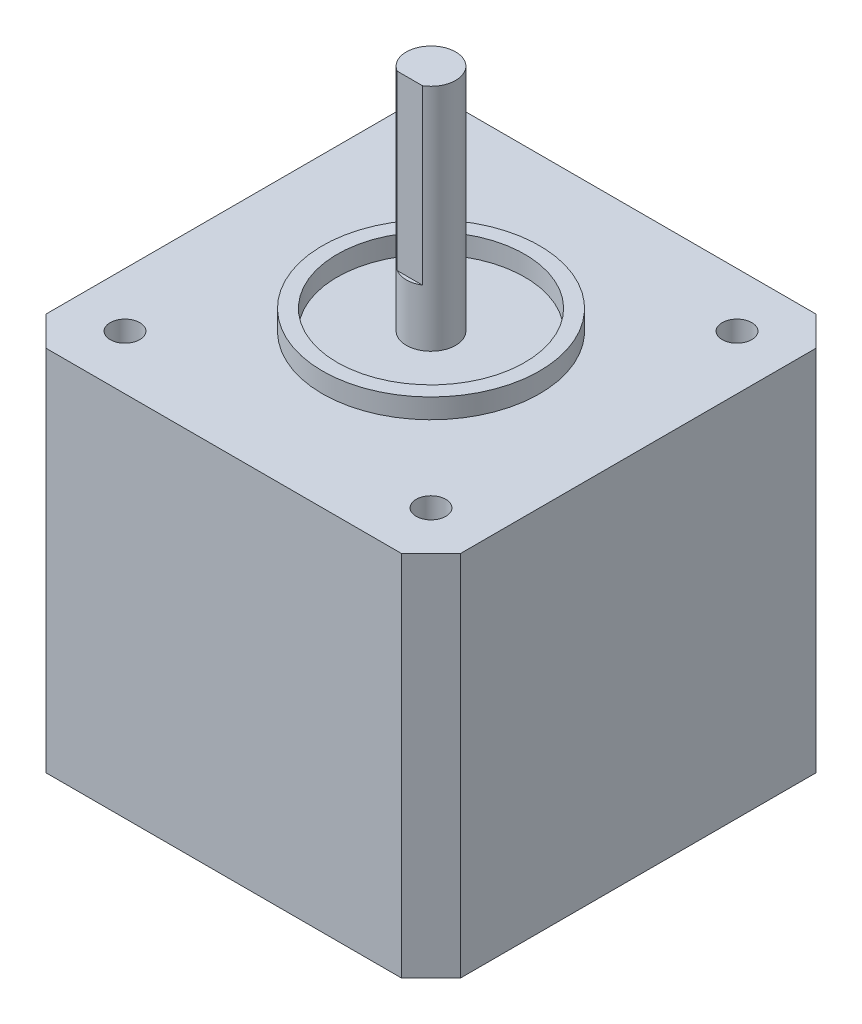
ISO-10303-21;
HEADER;
FILE_DESCRIPTION(('STEP AP214'),'2;1');
FILE_NAME('part.step','',(''),(''),'','','');
FILE_SCHEMA(('AUTOMOTIVE_DESIGN { 1 0 10303 214 1 1 1 1 }'));
ENDSEC;
DATA;
#1=APPLICATION_CONTEXT('core data for automotive mechanical design processes');
#2=APPLICATION_PROTOCOL_DEFINITION('international standard','automotive_design',2000,#1);
#3=PRODUCT_CONTEXT('',#1,'mechanical');
#4=PRODUCT('Part','Part','',(#3));
#5=PRODUCT_RELATED_PRODUCT_CATEGORY('part','',(#4));
#6=PRODUCT_DEFINITION_FORMATION('','',#4);
#7=PRODUCT_DEFINITION_CONTEXT('part definition',#1,'design');
#8=PRODUCT_DEFINITION('design','',#6,#7);
#9=PRODUCT_DEFINITION_SHAPE('','',#8);
#10=(LENGTH_UNIT() NAMED_UNIT(*) SI_UNIT(.MILLI.,.METRE.));
#11=(NAMED_UNIT(*) PLANE_ANGLE_UNIT() SI_UNIT($,.RADIAN.));
#12=(NAMED_UNIT(*) SI_UNIT($,.STERADIAN.) SOLID_ANGLE_UNIT());
#13=UNCERTAINTY_MEASURE_WITH_UNIT(LENGTH_MEASURE(1.E-05),#10,'distance_accuracy_value','');
#14=(GEOMETRIC_REPRESENTATION_CONTEXT(3) GLOBAL_UNCERTAINTY_ASSIGNED_CONTEXT((#13)) GLOBAL_UNIT_ASSIGNED_CONTEXT((#10,
#11,#12)) REPRESENTATION_CONTEXT('',''));
#15=CARTESIAN_POINT('',(0.,0.,0.));
#16=DIRECTION('',(0.,0.,1.));
#17=DIRECTION('',(1.,0.,0.));
#18=AXIS2_PLACEMENT_3D('',#15,#16,#17);
#19=CARTESIAN_POINT('',(0.,30.4219329235866,0.));
#20=DIRECTION('',(0.,1.,0.));
#21=DIRECTION('',(0.,0.,1.));
#22=AXIS2_PLACEMENT_3D('',#19,#20,#21);
#23=CYLINDRICAL_SURFACE('',#22,2.5);
#24=DIRECTION('',(0.,1.,0.));
#25=VECTOR('',#24,1.);
#26=CARTESIAN_POINT('',(1.27573508221731,30.4219329235866,2.15));
#27=LINE('',#26,#25);
#28=CARTESIAN_POINT('',(1.27573508221731,43.,2.15));
#29=VERTEX_POINT('',#28);
#30=CARTESIAN_POINT('',(1.27573508221731,60.5,2.15));
#31=VERTEX_POINT('',#30);
#32=EDGE_CURVE('E53',#29,#31,#27,.T.);
#33=ORIENTED_EDGE('',*,*,#32,.F.);
#34=CARTESIAN_POINT('',(0.,43.,0.));
#35=DIRECTION('',(0.,1.,0.));
#36=DIRECTION('',(0.,0.,1.));
#37=AXIS2_PLACEMENT_3D('',#34,#35,#36);
#38=CIRCLE('',#37,2.5);
#39=CARTESIAN_POINT('',(-1.27573508221731,43.,2.15));
#40=VERTEX_POINT('',#39);
#41=EDGE_CURVE('E175',#40,#29,#38,.T.);
#42=ORIENTED_EDGE('',*,*,#41,.F.);
#43=DIRECTION('',(0.,1.,0.));
#44=VECTOR('',#43,1.);
#45=CARTESIAN_POINT('',(-1.27573508221731,30.4219329235866,2.15));
#46=LINE('',#45,#44);
#47=CARTESIAN_POINT('',(-1.27573508221731,60.5,2.15));
#48=VERTEX_POINT('',#47);
#49=EDGE_CURVE('E186',#40,#48,#46,.T.);
#50=ORIENTED_EDGE('',*,*,#49,.T.);
#51=CARTESIAN_POINT('',(0.,60.5,0.));
#52=DIRECTION('',(0.,1.,0.));
#53=DIRECTION('',(0.,0.,1.));
#54=AXIS2_PLACEMENT_3D('',#51,#52,#53);
#55=CIRCLE('',#54,2.5);
#56=EDGE_CURVE('E178',#31,#48,#55,.T.);
#57=ORIENTED_EDGE('',*,*,#56,.F.);
#58=EDGE_LOOP('',(#33,#42,#50,#57));
#59=FACE_BOUND('',#58,.T.);
#60=CARTESIAN_POINT('',(0.,37.25,0.));
#61=DIRECTION('',(0.,1.,0.));
#62=DIRECTION('',(0.,0.,1.));
#63=AXIS2_PLACEMENT_3D('',#60,#61,#62);
#64=CIRCLE('',#63,2.5);
#65=CARTESIAN_POINT('',(0.,37.25,2.5));
#66=VERTEX_POINT('',#65);
#67=EDGE_CURVE('E44',#66,#66,#64,.F.);
#68=ORIENTED_EDGE('',*,*,#67,.F.);
#69=EDGE_LOOP('',(#68));
#70=FACE_BOUND('',#69,.T.);
#71=ADVANCED_FACE('F37',(#59,#70),#23,.T.);
#72=CARTESIAN_POINT('',(-1.27573508221731,30.4219329235866,2.15));
#73=DIRECTION('',(0.,0.,1.));
#74=DIRECTION('',(1.,0.,0.));
#75=AXIS2_PLACEMENT_3D('',#72,#73,#74);
#76=PLANE('',#75);
#77=DIRECTION('',(-1.,0.,0.));
#78=VECTOR('',#77,1.);
#79=CARTESIAN_POINT('',(-1.27573508221731,43.,2.15));
#80=LINE('',#79,#78);
#81=EDGE_CURVE('E12',#29,#40,#80,.T.);
#82=ORIENTED_EDGE('',*,*,#81,.F.);
#83=ORIENTED_EDGE('',*,*,#32,.T.);
#84=DIRECTION('',(1.,0.,0.));
#85=VECTOR('',#84,1.);
#86=CARTESIAN_POINT('',(-1.27573508221731,60.5,2.15));
#87=LINE('',#86,#85);
#88=EDGE_CURVE('E183',#48,#31,#87,.T.);
#89=ORIENTED_EDGE('',*,*,#88,.F.);
#90=ORIENTED_EDGE('',*,*,#49,.F.);
#91=EDGE_LOOP('',(#82,#83,#89,#90));
#92=FACE_BOUND('',#91,.T.);
#93=ADVANCED_FACE('F192',(#92),#76,.T.);
#94=CARTESIAN_POINT('',(0.,60.5,0.));
#95=DIRECTION('',(0.,1.,0.));
#96=DIRECTION('',(0.,0.,1.));
#97=AXIS2_PLACEMENT_3D('',#94,#95,#96);
#98=PLANE('',#97);
#99=ORIENTED_EDGE('',*,*,#56,.T.);
#100=ORIENTED_EDGE('',*,*,#88,.T.);
#101=EDGE_LOOP('',(#99,#100));
#102=FACE_BOUND('',#101,.T.);
#103=ADVANCED_FACE('F191',(#102),#98,.T.);
#104=CARTESIAN_POINT('',(0.,43.,0.));
#105=DIRECTION('',(0.,1.,0.));
#106=DIRECTION('',(0.,0.,1.));
#107=AXIS2_PLACEMENT_3D('',#104,#105,#106);
#108=PLANE('',#107);
#109=ORIENTED_EDGE('',*,*,#41,.T.);
#110=ORIENTED_EDGE('',*,*,#81,.T.);
#111=EDGE_LOOP('',(#109,#110));
#112=FACE_BOUND('',#111,.T.);
#113=ADVANCED_FACE('F198',(#112),#108,.T.);
#114=CARTESIAN_POINT('',(21.,37.25,-21.));
#115=DIRECTION('',(-1.,0.,0.));
#116=DIRECTION('',(0.,0.,1.));
#117=AXIS2_PLACEMENT_3D('',#114,#115,#116);
#118=PLANE('',#117);
#119=DIRECTION('',(0.,0.,-1.));
#120=VECTOR('',#119,1.);
#121=CARTESIAN_POINT('',(21.,0.,-21.));
#122=LINE('',#121,#120);
#123=CARTESIAN_POINT('',(21.,0.,18.));
#124=VERTEX_POINT('',#123);
#125=CARTESIAN_POINT('',(21.,0.,-18.));
#126=VERTEX_POINT('',#125);
#127=EDGE_CURVE('E344',#124,#126,#122,.T.);
#128=ORIENTED_EDGE('',*,*,#127,.T.);
#129=DIRECTION('',(0.,1.,0.));
#130=VECTOR('',#129,1.);
#131=CARTESIAN_POINT('',(21.,37.25,-18.));
#132=LINE('',#131,#130);
#133=CARTESIAN_POINT('',(21.,37.25,-18.));
#134=VERTEX_POINT('',#133);
#135=EDGE_CURVE('E173',#126,#134,#132,.T.);
#136=ORIENTED_EDGE('',*,*,#135,.T.);
#137=DIRECTION('',(0.,0.,-1.));
#138=VECTOR('',#137,1.);
#139=CARTESIAN_POINT('',(21.,37.25,-21.));
#140=LINE('',#139,#138);
#141=CARTESIAN_POINT('',(21.,37.25,18.));
#142=VERTEX_POINT('',#141);
#143=EDGE_CURVE('E136',#142,#134,#140,.T.);
#144=ORIENTED_EDGE('',*,*,#143,.F.);
#145=DIRECTION('',(0.,-1.,0.));
#146=VECTOR('',#145,1.);
#147=CARTESIAN_POINT('',(21.,37.25,18.));
#148=LINE('',#147,#146);
#149=EDGE_CURVE('E170',#142,#124,#148,.T.);
#150=ORIENTED_EDGE('',*,*,#149,.T.);
#151=EDGE_LOOP('',(#128,#136,#144,#150));
#152=FACE_BOUND('',#151,.T.);
#153=ADVANCED_FACE('F203',(#152),#118,.F.);
#154=CARTESIAN_POINT('',(-21.,37.25,-21.));
#155=DIRECTION('',(0.,0.,1.));
#156=DIRECTION('',(1.,0.,0.));
#157=AXIS2_PLACEMENT_3D('',#154,#155,#156);
#158=PLANE('',#157);
#159=DIRECTION('',(-1.,0.,0.));
#160=VECTOR('',#159,1.);
#161=CARTESIAN_POINT('',(-21.,0.,-21.));
#162=LINE('',#161,#160);
#163=CARTESIAN_POINT('',(18.,0.,-21.));
#164=VERTEX_POINT('',#163);
#165=CARTESIAN_POINT('',(-18.,0.,-21.));
#166=VERTEX_POINT('',#165);
#167=EDGE_CURVE('E142',#164,#166,#162,.T.);
#168=ORIENTED_EDGE('',*,*,#167,.T.);
#169=DIRECTION('',(0.,1.,0.));
#170=VECTOR('',#169,1.);
#171=CARTESIAN_POINT('',(-18.,37.25,-21.));
#172=LINE('',#171,#170);
#173=CARTESIAN_POINT('',(-18.,37.25,-21.));
#174=VERTEX_POINT('',#173);
#175=EDGE_CURVE('E168',#166,#174,#172,.T.);
#176=ORIENTED_EDGE('',*,*,#175,.T.);
#177=DIRECTION('',(-1.,0.,0.));
#178=VECTOR('',#177,1.);
#179=CARTESIAN_POINT('',(-21.,37.25,-21.));
#180=LINE('',#179,#178);
#181=CARTESIAN_POINT('',(18.,37.25,-21.));
#182=VERTEX_POINT('',#181);
#183=EDGE_CURVE('E140',#182,#174,#180,.T.);
#184=ORIENTED_EDGE('',*,*,#183,.F.);
#185=DIRECTION('',(0.,-1.,0.));
#186=VECTOR('',#185,1.);
#187=CARTESIAN_POINT('',(18.,37.25,-21.));
#188=LINE('',#187,#186);
#189=EDGE_CURVE('E165',#182,#164,#188,.T.);
#190=ORIENTED_EDGE('',*,*,#189,.T.);
#191=EDGE_LOOP('',(#168,#176,#184,#190));
#192=FACE_BOUND('',#191,.T.);
#193=ADVANCED_FACE('F235',(#192),#158,.F.);
#194=CARTESIAN_POINT('',(-21.,37.25,-21.));
#195=DIRECTION('',(1.,0.,0.));
#196=DIRECTION('',(0.,0.,-1.));
#197=AXIS2_PLACEMENT_3D('',#194,#195,#196);
#198=PLANE('',#197);
#199=DIRECTION('',(0.,0.,1.));
#200=VECTOR('',#199,1.);
#201=CARTESIAN_POINT('',(-21.,0.,-21.));
#202=LINE('',#201,#200);
#203=CARTESIAN_POINT('',(-21.,0.,-18.));
#204=VERTEX_POINT('',#203);
#205=CARTESIAN_POINT('',(-21.,0.,18.));
#206=VERTEX_POINT('',#205);
#207=EDGE_CURVE('E137',#204,#206,#202,.T.);
#208=ORIENTED_EDGE('',*,*,#207,.T.);
#209=DIRECTION('',(0.,1.,0.));
#210=VECTOR('',#209,1.);
#211=CARTESIAN_POINT('',(-21.,37.25,18.));
#212=LINE('',#211,#210);
#213=CARTESIAN_POINT('',(-21.,37.25,18.));
#214=VERTEX_POINT('',#213);
#215=EDGE_CURVE('E115',#206,#214,#212,.T.);
#216=ORIENTED_EDGE('',*,*,#215,.T.);
#217=DIRECTION('',(0.,0.,1.));
#218=VECTOR('',#217,1.);
#219=CARTESIAN_POINT('',(-21.,37.25,-21.));
#220=LINE('',#219,#218);
#221=CARTESIAN_POINT('',(-21.,37.25,-18.));
#222=VERTEX_POINT('',#221);
#223=EDGE_CURVE('E349',#222,#214,#220,.T.);
#224=ORIENTED_EDGE('',*,*,#223,.F.);
#225=DIRECTION('',(0.,-1.,0.));
#226=VECTOR('',#225,1.);
#227=CARTESIAN_POINT('',(-21.,37.25,-18.));
#228=LINE('',#227,#226);
#229=EDGE_CURVE('E120',#222,#204,#228,.T.);
#230=ORIENTED_EDGE('',*,*,#229,.T.);
#231=EDGE_LOOP('',(#208,#216,#224,#230));
#232=FACE_BOUND('',#231,.T.);
#233=ADVANCED_FACE('F239',(#232),#198,.F.);
#234=CARTESIAN_POINT('',(-21.,37.25,21.));
#235=DIRECTION('',(0.,0.,-1.));
#236=DIRECTION('',(-1.,0.,0.));
#237=AXIS2_PLACEMENT_3D('',#234,#235,#236);
#238=PLANE('',#237);
#239=DIRECTION('',(1.,0.,0.));
#240=VECTOR('',#239,1.);
#241=CARTESIAN_POINT('',(-21.,37.25,21.));
#242=LINE('',#241,#240);
#243=CARTESIAN_POINT('',(-18.,37.25,21.));
#244=VERTEX_POINT('',#243);
#245=CARTESIAN_POINT('',(18.,37.25,21.));
#246=VERTEX_POINT('',#245);
#247=EDGE_CURVE('E130',#244,#246,#242,.T.);
#248=ORIENTED_EDGE('',*,*,#247,.F.);
#249=DIRECTION('',(0.,-1.,0.));
#250=VECTOR('',#249,1.);
#251=CARTESIAN_POINT('',(-18.,37.25,21.));
#252=LINE('',#251,#250);
#253=CARTESIAN_POINT('',(-18.,0.,21.));
#254=VERTEX_POINT('',#253);
#255=EDGE_CURVE('E114',#244,#254,#252,.T.);
#256=ORIENTED_EDGE('',*,*,#255,.T.);
#257=DIRECTION('',(1.,0.,0.));
#258=VECTOR('',#257,1.);
#259=CARTESIAN_POINT('',(-21.,0.,21.));
#260=LINE('',#259,#258);
#261=CARTESIAN_POINT('',(18.,0.,21.));
#262=VERTEX_POINT('',#261);
#263=EDGE_CURVE('E127',#254,#262,#260,.T.);
#264=ORIENTED_EDGE('',*,*,#263,.T.);
#265=DIRECTION('',(0.,1.,0.));
#266=VECTOR('',#265,1.);
#267=CARTESIAN_POINT('',(18.,37.25,21.));
#268=LINE('',#267,#266);
#269=EDGE_CURVE('E132',#262,#246,#268,.T.);
#270=ORIENTED_EDGE('',*,*,#269,.T.);
#271=EDGE_LOOP('',(#248,#256,#264,#270));
#272=FACE_BOUND('',#271,.T.);
#273=ADVANCED_FACE('F126',(#272),#238,.F.);
#274=CARTESIAN_POINT('',(0.,37.25,0.));
#275=DIRECTION('',(0.,1.,0.));
#276=DIRECTION('',(0.,0.,1.));
#277=AXIS2_PLACEMENT_3D('',#274,#275,#276);
#278=PLANE('',#277);
#279=CARTESIAN_POINT('',(0.,37.25,0.));
#280=DIRECTION('',(0.,1.,0.));
#281=DIRECTION('',(0.,0.,1.));
#282=AXIS2_PLACEMENT_3D('',#279,#280,#281);
#283=CIRCLE('',#282,11.);
#284=CARTESIAN_POINT('',(0.,37.25,11.));
#285=VERTEX_POINT('',#284);
#286=EDGE_CURVE('E312',#285,#285,#283,.T.);
#287=ORIENTED_EDGE('',*,*,#286,.F.);
#288=EDGE_LOOP('',(#287));
#289=FACE_BOUND('',#288,.T.);
#290=CARTESIAN_POINT('',(-15.5,37.25,-15.5));
#291=DIRECTION('',(0.,1.,0.));
#292=DIRECTION('',(0.,0.,1.));
#293=AXIS2_PLACEMENT_3D('',#290,#291,#292);
#294=CIRCLE('',#293,1.5);
#295=CARTESIAN_POINT('',(-15.5,37.25,-14.));
#296=VERTEX_POINT('',#295);
#297=EDGE_CURVE('E320',#296,#296,#294,.T.);
#298=ORIENTED_EDGE('',*,*,#297,.F.);
#299=EDGE_LOOP('',(#298));
#300=FACE_BOUND('',#299,.T.);
#301=CARTESIAN_POINT('',(-15.5,37.25,15.5));
#302=DIRECTION('',(0.,1.,0.));
#303=DIRECTION('',(0.,0.,1.));
#304=AXIS2_PLACEMENT_3D('',#301,#302,#303);
#305=CIRCLE('',#304,1.5);
#306=CARTESIAN_POINT('',(-15.5,37.25,17.));
#307=VERTEX_POINT('',#306);
#308=EDGE_CURVE('E333',#307,#307,#305,.T.);
#309=ORIENTED_EDGE('',*,*,#308,.F.);
#310=EDGE_LOOP('',(#309));
#311=FACE_BOUND('',#310,.T.);
#312=CARTESIAN_POINT('',(15.5,37.25,15.5));
#313=DIRECTION('',(0.,1.,0.));
#314=DIRECTION('',(0.,0.,1.));
#315=AXIS2_PLACEMENT_3D('',#312,#313,#314);
#316=CIRCLE('',#315,1.5);
#317=CARTESIAN_POINT('',(15.5,37.25,17.));
#318=VERTEX_POINT('',#317);
#319=EDGE_CURVE('E327',#318,#318,#316,.T.);
#320=ORIENTED_EDGE('',*,*,#319,.F.);
#321=EDGE_LOOP('',(#320));
#322=FACE_BOUND('',#321,.T.);
#323=CARTESIAN_POINT('',(15.5,37.25,-15.5));
#324=DIRECTION('',(0.,1.,0.));
#325=DIRECTION('',(0.,0.,1.));
#326=AXIS2_PLACEMENT_3D('',#323,#324,#325);
#327=CIRCLE('',#326,1.5);
#328=CARTESIAN_POINT('',(15.5,37.25,-14.));
#329=VERTEX_POINT('',#328);
#330=EDGE_CURVE('E326',#329,#329,#327,.T.);
#331=ORIENTED_EDGE('',*,*,#330,.F.);
#332=EDGE_LOOP('',(#331));
#333=FACE_BOUND('',#332,.T.);
#334=ORIENTED_EDGE('',*,*,#223,.T.);
#335=DIRECTION('',(-0.707106781186548,0.,-0.707106781186548));
#336=VECTOR('',#335,1.);
#337=CARTESIAN_POINT('',(-19.5,37.25,19.5));
#338=LINE('',#337,#336);
#339=EDGE_CURVE('E163',#214,#244,#338,.F.);
#340=ORIENTED_EDGE('',*,*,#339,.T.);
#341=ORIENTED_EDGE('',*,*,#247,.T.);
#342=DIRECTION('',(-0.707106781186547,0.,0.707106781186548));
#343=VECTOR('',#342,1.);
#344=CARTESIAN_POINT('',(19.5,37.25,19.5));
#345=LINE('',#344,#343);
#346=EDGE_CURVE('E157',#246,#142,#345,.F.);
#347=ORIENTED_EDGE('',*,*,#346,.T.);
#348=ORIENTED_EDGE('',*,*,#143,.T.);
#349=DIRECTION('',(0.707106781186548,0.,0.707106781186548));
#350=VECTOR('',#349,1.);
#351=CARTESIAN_POINT('',(19.5,37.25,-19.5));
#352=LINE('',#351,#350);
#353=EDGE_CURVE('E159',#134,#182,#352,.F.);
#354=ORIENTED_EDGE('',*,*,#353,.T.);
#355=ORIENTED_EDGE('',*,*,#183,.T.);
#356=DIRECTION('',(0.707106781186548,0.,-0.707106781186548));
#357=VECTOR('',#356,1.);
#358=CARTESIAN_POINT('',(-19.5,37.25,-19.5));
#359=LINE('',#358,#357);
#360=EDGE_CURVE('E161',#174,#222,#359,.F.);
#361=ORIENTED_EDGE('',*,*,#360,.T.);
#362=EDGE_LOOP('',(#334,#340,#341,#347,#348,#354,#355,#361));
#363=FACE_BOUND('',#362,.T.);
#364=ADVANCED_FACE('F246',(#289,#300,#311,#322,#333,#363),#278,.T.);
#365=CARTESIAN_POINT('',(0.,0.,0.));
#366=DIRECTION('',(0.,1.,0.));
#367=DIRECTION('',(0.,0.,1.));
#368=AXIS2_PLACEMENT_3D('',#365,#366,#367);
#369=PLANE('',#368);
#370=CARTESIAN_POINT('',(0.,0.,0.));
#371=DIRECTION('',(0.,-1.,0.));
#372=DIRECTION('',(0.,0.,-1.));
#373=AXIS2_PLACEMENT_3D('',#370,#371,#372);
#374=CIRCLE('',#373,4.5);
#375=CARTESIAN_POINT('',(0.,0.,-4.5));
#376=VERTEX_POINT('',#375);
#377=EDGE_CURVE('E309',#376,#376,#374,.T.);
#378=ORIENTED_EDGE('',*,*,#377,.F.);
#379=EDGE_LOOP('',(#378));
#380=FACE_BOUND('',#379,.T.);
#381=ORIENTED_EDGE('',*,*,#263,.F.);
#382=DIRECTION('',(0.707106781186548,0.,0.707106781186548));
#383=VECTOR('',#382,1.);
#384=CARTESIAN_POINT('',(-18.,0.,21.));
#385=LINE('',#384,#383);
#386=EDGE_CURVE('E110',#254,#206,#385,.F.);
#387=ORIENTED_EDGE('',*,*,#386,.T.);
#388=ORIENTED_EDGE('',*,*,#207,.F.);
#389=DIRECTION('',(-0.707106781186548,0.,0.707106781186548));
#390=VECTOR('',#389,1.);
#391=CARTESIAN_POINT('',(-21.,0.,-18.));
#392=LINE('',#391,#390);
#393=EDGE_CURVE('E121',#204,#166,#392,.F.);
#394=ORIENTED_EDGE('',*,*,#393,.T.);
#395=ORIENTED_EDGE('',*,*,#167,.F.);
#396=DIRECTION('',(-0.707106781186548,0.,-0.707106781186548));
#397=VECTOR('',#396,1.);
#398=CARTESIAN_POINT('',(18.,0.,-21.));
#399=LINE('',#398,#397);
#400=EDGE_CURVE('E151',#164,#126,#399,.F.);
#401=ORIENTED_EDGE('',*,*,#400,.T.);
#402=ORIENTED_EDGE('',*,*,#127,.F.);
#403=DIRECTION('',(0.707106781186547,0.,-0.707106781186548));
#404=VECTOR('',#403,1.);
#405=CARTESIAN_POINT('',(21.,0.,18.));
#406=LINE('',#405,#404);
#407=EDGE_CURVE('E131',#124,#262,#406,.F.);
#408=ORIENTED_EDGE('',*,*,#407,.T.);
#409=EDGE_LOOP('',(#381,#387,#388,#394,#395,#401,#402,#408));
#410=FACE_BOUND('',#409,.T.);
#411=ADVANCED_FACE('F134',(#380,#410),#369,.F.);
#412=CARTESIAN_POINT('',(15.5,32.25,-15.5));
#413=DIRECTION('',(0.,1.,0.));
#414=DIRECTION('',(0.,0.,1.));
#415=AXIS2_PLACEMENT_3D('',#412,#413,#414);
#416=CYLINDRICAL_SURFACE('',#415,1.5);
#417=CARTESIAN_POINT('',(15.5,32.25,-15.5));
#418=DIRECTION('',(0.,1.,0.));
#419=DIRECTION('',(0.,0.,1.));
#420=AXIS2_PLACEMENT_3D('',#417,#418,#419);
#421=CIRCLE('',#420,1.5);
#422=CARTESIAN_POINT('',(15.5,32.25,-14.));
#423=VERTEX_POINT('',#422);
#424=EDGE_CURVE('E341',#423,#423,#421,.T.);
#425=ORIENTED_EDGE('',*,*,#424,.F.);
#426=EDGE_LOOP('',(#425));
#427=FACE_BOUND('',#426,.T.);
#428=ORIENTED_EDGE('',*,*,#330,.T.);
#429=EDGE_LOOP('',(#428));
#430=FACE_BOUND('',#429,.T.);
#431=ADVANCED_FACE('F249',(#427,#430),#416,.F.);
#432=CARTESIAN_POINT('',(15.5,32.25,-15.5));
#433=DIRECTION('',(0.,1.,0.));
#434=DIRECTION('',(0.,0.,1.));
#435=AXIS2_PLACEMENT_3D('',#432,#433,#434);
#436=PLANE('',#435);
#437=ORIENTED_EDGE('',*,*,#424,.T.);
#438=EDGE_LOOP('',(#437));
#439=FACE_BOUND('',#438,.T.);
#440=ADVANCED_FACE('F256',(#439),#436,.T.);
#441=CARTESIAN_POINT('',(15.5,32.25,15.5));
#442=DIRECTION('',(0.,1.,0.));
#443=DIRECTION('',(0.,0.,1.));
#444=AXIS2_PLACEMENT_3D('',#441,#442,#443);
#445=CYLINDRICAL_SURFACE('',#444,1.5);
#446=CARTESIAN_POINT('',(15.5,32.25,15.5));
#447=DIRECTION('',(0.,1.,0.));
#448=DIRECTION('',(0.,0.,1.));
#449=AXIS2_PLACEMENT_3D('',#446,#447,#448);
#450=CIRCLE('',#449,1.5);
#451=CARTESIAN_POINT('',(15.5,32.25,17.));
#452=VERTEX_POINT('',#451);
#453=EDGE_CURVE('E323',#452,#452,#450,.T.);
#454=ORIENTED_EDGE('',*,*,#453,.F.);
#455=EDGE_LOOP('',(#454));
#456=FACE_BOUND('',#455,.T.);
#457=ORIENTED_EDGE('',*,*,#319,.T.);
#458=EDGE_LOOP('',(#457));
#459=FACE_BOUND('',#458,.T.);
#460=ADVANCED_FACE('F260',(#456,#459),#445,.F.);
#461=CARTESIAN_POINT('',(15.5,32.25,15.5));
#462=DIRECTION('',(0.,1.,0.));
#463=DIRECTION('',(0.,0.,1.));
#464=AXIS2_PLACEMENT_3D('',#461,#462,#463);
#465=PLANE('',#464);
#466=ORIENTED_EDGE('',*,*,#453,.T.);
#467=EDGE_LOOP('',(#466));
#468=FACE_BOUND('',#467,.T.);
#469=ADVANCED_FACE('F275',(#468),#465,.T.);
#470=CARTESIAN_POINT('',(-15.5,32.25,15.5));
#471=DIRECTION('',(0.,1.,0.));
#472=DIRECTION('',(0.,0.,1.));
#473=AXIS2_PLACEMENT_3D('',#470,#471,#472);
#474=CYLINDRICAL_SURFACE('',#473,1.5);
#475=CARTESIAN_POINT('',(-15.5,32.25,15.5));
#476=DIRECTION('',(0.,1.,0.));
#477=DIRECTION('',(0.,0.,1.));
#478=AXIS2_PLACEMENT_3D('',#475,#476,#477);
#479=CIRCLE('',#478,1.5);
#480=CARTESIAN_POINT('',(-15.5,32.25,17.));
#481=VERTEX_POINT('',#480);
#482=EDGE_CURVE('E330',#481,#481,#479,.T.);
#483=ORIENTED_EDGE('',*,*,#482,.F.);
#484=EDGE_LOOP('',(#483));
#485=FACE_BOUND('',#484,.T.);
#486=ORIENTED_EDGE('',*,*,#308,.T.);
#487=EDGE_LOOP('',(#486));
#488=FACE_BOUND('',#487,.T.);
#489=ADVANCED_FACE('F272',(#485,#488),#474,.F.);
#490=CARTESIAN_POINT('',(-15.5,32.25,15.5));
#491=DIRECTION('',(0.,1.,0.));
#492=DIRECTION('',(0.,0.,1.));
#493=AXIS2_PLACEMENT_3D('',#490,#491,#492);
#494=PLANE('',#493);
#495=ORIENTED_EDGE('',*,*,#482,.T.);
#496=EDGE_LOOP('',(#495));
#497=FACE_BOUND('',#496,.T.);
#498=ADVANCED_FACE('F266',(#497),#494,.T.);
#499=CARTESIAN_POINT('',(-15.5,32.25,-15.5));
#500=DIRECTION('',(0.,1.,0.));
#501=DIRECTION('',(0.,0.,1.));
#502=AXIS2_PLACEMENT_3D('',#499,#500,#501);
#503=CYLINDRICAL_SURFACE('',#502,1.5);
#504=CARTESIAN_POINT('',(-15.5,32.25,-15.5));
#505=DIRECTION('',(0.,1.,0.));
#506=DIRECTION('',(0.,0.,1.));
#507=AXIS2_PLACEMENT_3D('',#504,#505,#506);
#508=CIRCLE('',#507,1.5);
#509=CARTESIAN_POINT('',(-15.5,32.25,-14.));
#510=VERTEX_POINT('',#509);
#511=EDGE_CURVE('E336',#510,#510,#508,.T.);
#512=ORIENTED_EDGE('',*,*,#511,.F.);
#513=EDGE_LOOP('',(#512));
#514=FACE_BOUND('',#513,.T.);
#515=ORIENTED_EDGE('',*,*,#297,.T.);
#516=EDGE_LOOP('',(#515));
#517=FACE_BOUND('',#516,.T.);
#518=ADVANCED_FACE('F262',(#514,#517),#503,.F.);
#519=CARTESIAN_POINT('',(-15.5,32.25,-15.5));
#520=DIRECTION('',(0.,1.,0.));
#521=DIRECTION('',(0.,0.,1.));
#522=AXIS2_PLACEMENT_3D('',#519,#520,#521);
#523=PLANE('',#522);
#524=ORIENTED_EDGE('',*,*,#511,.T.);
#525=EDGE_LOOP('',(#524));
#526=FACE_BOUND('',#525,.T.);
#527=ADVANCED_FACE('F265',(#526),#523,.T.);
#528=CARTESIAN_POINT('',(0.,39.25,0.));
#529=DIRECTION('',(0.,1.,0.));
#530=DIRECTION('',(0.,0.,1.));
#531=AXIS2_PLACEMENT_3D('',#528,#529,#530);
#532=PLANE('',#531);
#533=CARTESIAN_POINT('',(0.,39.25,0.));
#534=DIRECTION('',(0.,1.,0.));
#535=DIRECTION('',(0.,0.,1.));
#536=AXIS2_PLACEMENT_3D('',#533,#534,#535);
#537=CIRCLE('',#536,11.);
#538=CARTESIAN_POINT('',(0.,39.25,11.));
#539=VERTEX_POINT('',#538);
#540=EDGE_CURVE('E317',#539,#539,#537,.T.);
#541=ORIENTED_EDGE('',*,*,#540,.T.);
#542=EDGE_LOOP('',(#541));
#543=FACE_BOUND('',#542,.T.);
#544=CARTESIAN_POINT('',(0.,39.25,0.));
#545=DIRECTION('',(0.,1.,0.));
#546=DIRECTION('',(0.,0.,1.));
#547=AXIS2_PLACEMENT_3D('',#544,#545,#546);
#548=CIRCLE('',#547,9.5);
#549=CARTESIAN_POINT('',(0.,39.25,9.5));
#550=VERTEX_POINT('',#549);
#551=EDGE_CURVE('E308',#550,#550,#548,.T.);
#552=ORIENTED_EDGE('',*,*,#551,.F.);
#553=EDGE_LOOP('',(#552));
#554=FACE_BOUND('',#553,.T.);
#555=ADVANCED_FACE('F270',(#543,#554),#532,.T.);
#556=CARTESIAN_POINT('',(0.,39.25,0.));
#557=DIRECTION('',(0.,-1.,0.));
#558=DIRECTION('',(0.,0.,-1.));
#559=AXIS2_PLACEMENT_3D('',#556,#557,#558);
#560=CYLINDRICAL_SURFACE('',#559,11.);
#561=ORIENTED_EDGE('',*,*,#540,.F.);
#562=EDGE_LOOP('',(#561));
#563=FACE_BOUND('',#562,.T.);
#564=ORIENTED_EDGE('',*,*,#286,.T.);
#565=EDGE_LOOP('',(#564));
#566=FACE_BOUND('',#565,.T.);
#567=ADVANCED_FACE('F286',(#563,#566),#560,.T.);
#568=CARTESIAN_POINT('',(0.,39.25,0.));
#569=DIRECTION('',(0.,-1.,0.));
#570=DIRECTION('',(0.,0.,-1.));
#571=AXIS2_PLACEMENT_3D('',#568,#569,#570);
#572=CYLINDRICAL_SURFACE('',#571,9.5);
#573=ORIENTED_EDGE('',*,*,#551,.T.);
#574=EDGE_LOOP('',(#573));
#575=FACE_BOUND('',#574,.T.);
#576=CARTESIAN_POINT('',(0.,37.25,0.));
#577=DIRECTION('',(0.,1.,0.));
#578=DIRECTION('',(0.,0.,1.));
#579=AXIS2_PLACEMENT_3D('',#576,#577,#578);
#580=CIRCLE('',#579,9.5);
#581=CARTESIAN_POINT('',(0.,37.25,9.5));
#582=VERTEX_POINT('',#581);
#583=EDGE_CURVE('E146',#582,#582,#580,.F.);
#584=ORIENTED_EDGE('',*,*,#583,.T.);
#585=EDGE_LOOP('',(#584));
#586=FACE_BOUND('',#585,.T.);
#587=ADVANCED_FACE('F289',(#575,#586),#572,.F.);
#588=ORIENTED_EDGE('',*,*,#67,.T.);
#589=EDGE_LOOP('',(#588));
#590=FACE_BOUND('',#589,.T.);
#591=ORIENTED_EDGE('',*,*,#583,.F.);
#592=EDGE_LOOP('',(#591));
#593=FACE_BOUND('',#592,.T.);
#594=ADVANCED_FACE('F232',(#590,#593),#278,.T.);
#595=CARTESIAN_POINT('',(-18.,37.25,21.));
#596=DIRECTION('',(0.707106781186547,0.,-0.707106781186547));
#597=DIRECTION('',(0.,-1.,0.));
#598=AXIS2_PLACEMENT_3D('',#595,#596,#597);
#599=PLANE('',#598);
#600=ORIENTED_EDGE('',*,*,#339,.F.);
#601=ORIENTED_EDGE('',*,*,#215,.F.);
#602=ORIENTED_EDGE('',*,*,#386,.F.);
#603=ORIENTED_EDGE('',*,*,#255,.F.);
#604=EDGE_LOOP('',(#600,#601,#602,#603));
#605=FACE_BOUND('',#604,.T.);
#606=ADVANCED_FACE('F113',(#605),#599,.F.);
#607=CARTESIAN_POINT('',(-21.,37.25,-18.));
#608=DIRECTION('',(0.707106781186548,0.,0.707106781186548));
#609=DIRECTION('',(0.,-1.,0.));
#610=AXIS2_PLACEMENT_3D('',#607,#608,#609);
#611=PLANE('',#610);
#612=ORIENTED_EDGE('',*,*,#360,.F.);
#613=ORIENTED_EDGE('',*,*,#175,.F.);
#614=ORIENTED_EDGE('',*,*,#393,.F.);
#615=ORIENTED_EDGE('',*,*,#229,.F.);
#616=EDGE_LOOP('',(#612,#613,#614,#615));
#617=FACE_BOUND('',#616,.T.);
#618=ADVANCED_FACE('F220',(#617),#611,.F.);
#619=CARTESIAN_POINT('',(18.,37.25,-21.));
#620=DIRECTION('',(-0.707106781186547,0.,0.707106781186547));
#621=DIRECTION('',(0.,-1.,0.));
#622=AXIS2_PLACEMENT_3D('',#619,#620,#621);
#623=PLANE('',#622);
#624=ORIENTED_EDGE('',*,*,#353,.F.);
#625=ORIENTED_EDGE('',*,*,#135,.F.);
#626=ORIENTED_EDGE('',*,*,#400,.F.);
#627=ORIENTED_EDGE('',*,*,#189,.F.);
#628=EDGE_LOOP('',(#624,#625,#626,#627));
#629=FACE_BOUND('',#628,.T.);
#630=ADVANCED_FACE('F213',(#629),#623,.F.);
#631=CARTESIAN_POINT('',(21.,37.25,18.));
#632=DIRECTION('',(-0.707106781186548,0.,-0.707106781186547));
#633=DIRECTION('',(0.,-1.,0.));
#634=AXIS2_PLACEMENT_3D('',#631,#632,#633);
#635=PLANE('',#634);
#636=ORIENTED_EDGE('',*,*,#346,.F.);
#637=ORIENTED_EDGE('',*,*,#269,.F.);
#638=ORIENTED_EDGE('',*,*,#407,.F.);
#639=ORIENTED_EDGE('',*,*,#149,.F.);
#640=EDGE_LOOP('',(#636,#637,#638,#639));
#641=FACE_BOUND('',#640,.T.);
#642=ADVANCED_FACE('F206',(#641),#635,.F.);
#643=CARTESIAN_POINT('',(0.,3.25,0.));
#644=DIRECTION('',(0.,-1.,0.));
#645=DIRECTION('',(0.,0.,-1.));
#646=AXIS2_PLACEMENT_3D('',#643,#644,#645);
#647=CYLINDRICAL_SURFACE('',#646,4.5);
#648=CARTESIAN_POINT('',(0.,3.25,0.));
#649=DIRECTION('',(0.,-1.,0.));
#650=DIRECTION('',(0.,0.,-1.));
#651=AXIS2_PLACEMENT_3D('',#648,#649,#650);
#652=CIRCLE('',#651,4.5);
#653=CARTESIAN_POINT('',(0.,3.25,-4.5));
#654=VERTEX_POINT('',#653);
#655=EDGE_CURVE('E307',#654,#654,#652,.T.);
#656=ORIENTED_EDGE('',*,*,#655,.F.);
#657=EDGE_LOOP('',(#656));
#658=FACE_BOUND('',#657,.T.);
#659=ORIENTED_EDGE('',*,*,#377,.T.);
#660=EDGE_LOOP('',(#659));
#661=FACE_BOUND('',#660,.T.);
#662=ADVANCED_FACE('F212',(#658,#661),#647,.F.);
#663=CARTESIAN_POINT('',(0.,3.25,0.));
#664=DIRECTION('',(0.,-1.,0.));
#665=DIRECTION('',(0.,0.,-1.));
#666=AXIS2_PLACEMENT_3D('',#663,#664,#665);
#667=PLANE('',#666);
#668=ORIENTED_EDGE('',*,*,#655,.T.);
#669=EDGE_LOOP('',(#668));
#670=FACE_BOUND('',#669,.T.);
#671=ADVANCED_FACE('F299',(#670),#667,.T.);
#672=CLOSED_SHELL('',(#71,#93,#103,#113,#153,#193,#233,#273,#364,#411,#431,#440,#460,#469,#489,
#498,#518,#527,#555,#567,#587,#594,#606,#618,#630,#642,#662,#671));
#673=MANIFOLD_SOLID_BREP('B2',#672);
#674=ADVANCED_BREP_SHAPE_REPRESENTATION('',(#18,#673),#14);
#675=SHAPE_DEFINITION_REPRESENTATION(#9,#674);
ENDSEC;
END-ISO-10303-21;
